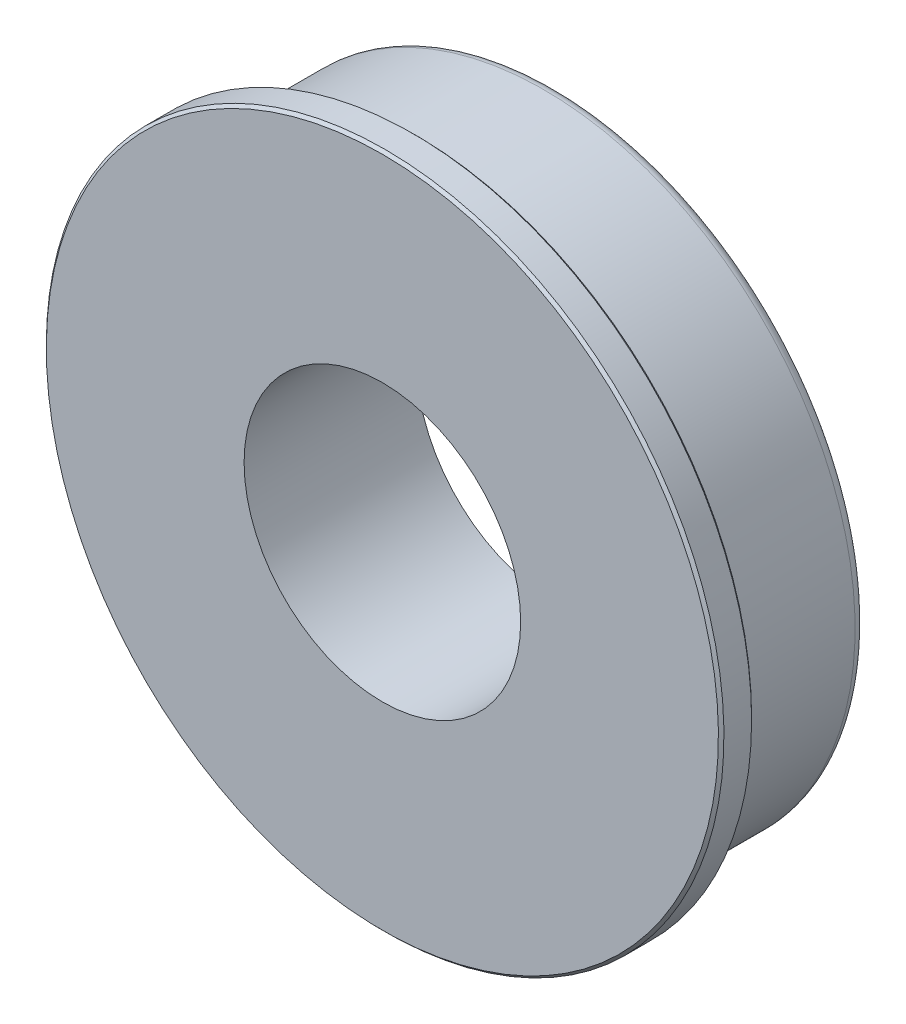
ISO-10303-21;
HEADER;
FILE_DESCRIPTION(('STEP AP214'),'2;1');
FILE_NAME('part.step','',(''),(''),'','','');
FILE_SCHEMA(('AUTOMOTIVE_DESIGN { 1 0 10303 214 1 1 1 1 }'));
ENDSEC;
DATA;
#1=APPLICATION_CONTEXT('core data for automotive mechanical design processes');
#2=APPLICATION_PROTOCOL_DEFINITION('international standard','automotive_design',2000,#1);
#3=PRODUCT_CONTEXT('',#1,'mechanical');
#4=PRODUCT('Part','Part','',(#3));
#5=PRODUCT_RELATED_PRODUCT_CATEGORY('part','',(#4));
#6=PRODUCT_DEFINITION_FORMATION('','',#4);
#7=PRODUCT_DEFINITION_CONTEXT('part definition',#1,'design');
#8=PRODUCT_DEFINITION('design','',#6,#7);
#9=PRODUCT_DEFINITION_SHAPE('','',#8);
#10=(LENGTH_UNIT() NAMED_UNIT(*) SI_UNIT(.MILLI.,.METRE.));
#11=(NAMED_UNIT(*) PLANE_ANGLE_UNIT() SI_UNIT($,.RADIAN.));
#12=(NAMED_UNIT(*) SI_UNIT($,.STERADIAN.) SOLID_ANGLE_UNIT());
#13=UNCERTAINTY_MEASURE_WITH_UNIT(LENGTH_MEASURE(1.E-05),#10,'distance_accuracy_value','');
#14=(GEOMETRIC_REPRESENTATION_CONTEXT(3) GLOBAL_UNCERTAINTY_ASSIGNED_CONTEXT((#13)) GLOBAL_UNIT_ASSIGNED_CONTEXT((#10,
#11,#12)) REPRESENTATION_CONTEXT('',''));
#15=CARTESIAN_POINT('',(0.,0.,0.));
#16=DIRECTION('',(0.,0.,1.));
#17=DIRECTION('',(1.,0.,0.));
#18=AXIS2_PLACEMENT_3D('',#15,#16,#17);
#19=CARTESIAN_POINT('',(0.,0.,-57.007125));
#20=DIRECTION('',(0.,0.,1.));
#21=DIRECTION('',(1.,0.,0.));
#22=AXIS2_PLACEMENT_3D('',#19,#20,#21);
#23=CYLINDRICAL_SURFACE('',#22,13.97);
#24=CARTESIAN_POINT('',(0.,0.,6.40334000025399));
#25=DIRECTION('',(0.,0.,1.));
#26=DIRECTION('',(1.,0.,0.));
#27=AXIS2_PLACEMENT_3D('',#24,#25,#26);
#28=CIRCLE('',#27,13.97);
#29=CARTESIAN_POINT('',(13.97,0.,6.40334000025399));
#30=VERTEX_POINT('',#29);
#31=EDGE_CURVE('E51',#30,#30,#28,.T.);
#32=ORIENTED_EDGE('',*,*,#31,.F.);
#33=EDGE_LOOP('',(#32));
#34=FACE_BOUND('',#33,.T.);
#35=CARTESIAN_POINT('',(0.,0.,5.895340000254));
#36=DIRECTION('',(0.,0.,1.));
#37=DIRECTION('',(1.,0.,0.));
#38=AXIS2_PLACEMENT_3D('',#35,#36,#37);
#39=CIRCLE('',#38,13.97);
#40=CARTESIAN_POINT('',(13.97,0.,5.895340000254));
#41=VERTEX_POINT('',#40);
#42=EDGE_CURVE('E48',#41,#41,#39,.T.);
#43=ORIENTED_EDGE('',*,*,#42,.T.);
#44=EDGE_LOOP('',(#43));
#45=FACE_BOUND('',#44,.T.);
#46=ADVANCED_FACE('F17',(#34,#45),#23,.T.);
#47=CARTESIAN_POINT('',(0.,47.3069264516129,5.89534));
#48=DIRECTION('',(0.,0.,-1.));
#49=DIRECTION('',(-1.,0.,0.));
#50=AXIS2_PLACEMENT_3D('',#47,#48,#49);
#51=PLANE('',#50);
#52=ORIENTED_EDGE('',*,*,#42,.F.);
#53=EDGE_LOOP('',(#52));
#54=FACE_BOUND('',#53,.T.);
#55=CARTESIAN_POINT('',(0.,0.,5.895340000254));
#56=DIRECTION('',(0.,0.,-1.));
#57=DIRECTION('',(-1.,0.,0.));
#58=AXIS2_PLACEMENT_3D('',#55,#56,#57);
#59=CIRCLE('',#58,14.2875);
#60=CARTESIAN_POINT('',(-14.2875,0.,5.895340000254));
#61=VERTEX_POINT('',#60);
#62=EDGE_CURVE('E54',#61,#61,#59,.T.);
#63=ORIENTED_EDGE('',*,*,#62,.F.);
#64=EDGE_LOOP('',(#63));
#65=FACE_BOUND('',#64,.T.);
#66=ADVANCED_FACE('F211',(#54,#65),#51,.F.);
#67=CARTESIAN_POINT('',(0.,0.,6.40334));
#68=DIRECTION('',(0.,0.,-1.));
#69=DIRECTION('',(-1.,0.,0.));
#70=AXIS2_PLACEMENT_3D('',#67,#68,#69);
#71=PLANE('',#70);
#72=ORIENTED_EDGE('',*,*,#31,.T.);
#73=EDGE_LOOP('',(#72));
#74=FACE_BOUND('',#73,.T.);
#75=CARTESIAN_POINT('',(0.,0.,6.40334000038116));
#76=DIRECTION('',(0.,0.,1.));
#77=DIRECTION('',(1.,0.,0.));
#78=AXIS2_PLACEMENT_3D('',#75,#76,#77);
#79=CIRCLE('',#78,15.4305000003808);
#80=CARTESIAN_POINT('',(15.4305000003808,0.,6.40334000038116));
#81=VERTEX_POINT('',#80);
#82=EDGE_CURVE('E57',#81,#81,#79,.T.);
#83=ORIENTED_EDGE('',*,*,#82,.F.);
#84=EDGE_LOOP('',(#83));
#85=FACE_BOUND('',#84,.T.);
#86=ADVANCED_FACE('F202',(#74,#85),#71,.T.);
#87=CARTESIAN_POINT('',(0.,0.,6.40334));
#88=DIRECTION('',(0.,0.,-1.));
#89=DIRECTION('',(-1.,0.,0.));
#90=AXIS2_PLACEMENT_3D('',#87,#88,#89);
#91=CYLINDRICAL_SURFACE('',#90,14.2875);
#92=CARTESIAN_POINT('',(0.,0.,0.508000000000015));
#93=DIRECTION('',(0.,0.,-1.));
#94=DIRECTION('',(-1.,0.,0.));
#95=AXIS2_PLACEMENT_3D('',#92,#93,#94);
#96=CIRCLE('',#95,14.2875);
#97=CARTESIAN_POINT('',(-14.2875,0.,0.508000000000015));
#98=VERTEX_POINT('',#97);
#99=EDGE_CURVE('E60',#98,#98,#96,.T.);
#100=ORIENTED_EDGE('',*,*,#99,.F.);
#101=EDGE_LOOP('',(#100));
#102=FACE_BOUND('',#101,.T.);
#103=ORIENTED_EDGE('',*,*,#62,.T.);
#104=EDGE_LOOP('',(#103));
#105=FACE_BOUND('',#104,.T.);
#106=ADVANCED_FACE('F193',(#102,#105),#91,.T.);
#107=CARTESIAN_POINT('',(0.,0.,6.53034000038083));
#108=DIRECTION('',(0.,0.,1.));
#109=DIRECTION('',(1.,0.,0.));
#110=AXIS2_PLACEMENT_3D('',#107,#108,#109);
#111=CONICAL_SURFACE('',#110,15.5575000003812,0.785398163399999);
#112=ORIENTED_EDGE('',*,*,#82,.T.);
#113=EDGE_LOOP('',(#112));
#114=FACE_BOUND('',#113,.T.);
#115=CARTESIAN_POINT('',(0.,0.,6.530340000254));
#116=DIRECTION('',(0.,0.,-1.));
#117=DIRECTION('',(-1.,0.,0.));
#118=AXIS2_PLACEMENT_3D('',#115,#116,#117);
#119=CIRCLE('',#118,15.5575);
#120=CARTESIAN_POINT('',(-15.5575,0.,6.530340000254));
#121=VERTEX_POINT('',#120);
#122=EDGE_CURVE('E46',#121,#121,#119,.F.);
#123=ORIENTED_EDGE('',*,*,#122,.F.);
#124=EDGE_LOOP('',(#123));
#125=FACE_BOUND('',#124,.T.);
#126=ADVANCED_FACE('F81',(#114,#125),#111,.T.);
#127=CARTESIAN_POINT('',(0.,0.,0.508000000000015));
#128=DIRECTION('',(0.,0.,-1.));
#129=DIRECTION('',(-1.,0.,0.));
#130=AXIS2_PLACEMENT_3D('',#127,#128,#129);
#131=TOROIDAL_SURFACE('',#130,13.7795,0.508);
#132=ORIENTED_EDGE('',*,*,#99,.T.);
#133=EDGE_LOOP('',(#132));
#134=FACE_BOUND('',#133,.T.);
#135=CARTESIAN_POINT('',(0.,0.,0.));
#136=DIRECTION('',(0.,0.,1.));
#137=DIRECTION('',(-1.,0.,0.));
#138=AXIS2_PLACEMENT_3D('',#135,#136,#137);
#139=CIRCLE('',#138,13.7795);
#140=CARTESIAN_POINT('',(13.7795,0.,0.));
#141=VERTEX_POINT('',#140);
#142=CARTESIAN_POINT('',(-13.7795,0.,0.));
#143=VERTEX_POINT('',#142);
#144=EDGE_CURVE('E37',#141,#143,#139,.F.);
#145=ORIENTED_EDGE('',*,*,#144,.F.);
#146=CARTESIAN_POINT('',(0.,0.,0.));
#147=DIRECTION('',(0.,0.,1.));
#148=DIRECTION('',(1.,0.,0.));
#149=AXIS2_PLACEMENT_3D('',#146,#147,#148);
#150=CIRCLE('',#149,13.7795);
#151=EDGE_CURVE('E34',#143,#141,#150,.F.);
#152=ORIENTED_EDGE('',*,*,#151,.F.);
#153=EDGE_LOOP('',(#145,#152));
#154=FACE_BOUND('',#153,.T.);
#155=ADVANCED_FACE('F45',(#134,#154),#131,.T.);
#156=CARTESIAN_POINT('',(0.,0.,7.92734));
#157=DIRECTION('',(0.,0.,-1.));
#158=DIRECTION('',(-1.,0.,0.));
#159=AXIS2_PLACEMENT_3D('',#156,#157,#158);
#160=CYLINDRICAL_SURFACE('',#159,15.5575);
#161=ORIENTED_EDGE('',*,*,#122,.T.);
#162=EDGE_LOOP('',(#161));
#163=FACE_BOUND('',#162,.T.);
#164=CARTESIAN_POINT('',(0.,0.,7.80034000012699));
#165=DIRECTION('',(0.,0.,-1.));
#166=DIRECTION('',(-1.,0.,0.));
#167=AXIS2_PLACEMENT_3D('',#164,#165,#166);
#168=CIRCLE('',#167,15.557499999873);
#169=CARTESIAN_POINT('',(-15.557499999873,0.,7.80034000012699));
#170=VERTEX_POINT('',#169);
#171=EDGE_CURVE('E42',#170,#170,#168,.F.);
#172=ORIENTED_EDGE('',*,*,#171,.F.);
#173=EDGE_LOOP('',(#172));
#174=FACE_BOUND('',#173,.T.);
#175=ADVANCED_FACE('F80',(#163,#174),#160,.T.);
#176=CARTESIAN_POINT('',(0.,0.,0.));
#177=DIRECTION('',(0.,0.,-1.));
#178=DIRECTION('',(-1.,0.,0.));
#179=AXIS2_PLACEMENT_3D('',#176,#177,#178);
#180=PLANE('',#179);
#181=CARTESIAN_POINT('',(0.,0.,0.));
#182=DIRECTION('',(0.,0.,1.));
#183=DIRECTION('',(1.,0.,0.));
#184=AXIS2_PLACEMENT_3D('',#181,#182,#183);
#185=CIRCLE('',#184,6.35);
#186=CARTESIAN_POINT('',(6.35000000000001,0.,0.));
#187=VERTEX_POINT('',#186);
#188=EDGE_CURVE('E61',#187,#187,#185,.T.);
#189=ORIENTED_EDGE('',*,*,#188,.T.);
#190=EDGE_LOOP('',(#189));
#191=FACE_BOUND('',#190,.T.);
#192=ORIENTED_EDGE('',*,*,#151,.T.);
#193=ORIENTED_EDGE('',*,*,#144,.T.);
#194=EDGE_LOOP('',(#192,#193));
#195=FACE_BOUND('',#194,.T.);
#196=ADVANCED_FACE('F39',(#191,#195),#180,.T.);
#197=CARTESIAN_POINT('',(0.,0.,7.80034000012699));
#198=DIRECTION('',(0.,0.,-1.));
#199=DIRECTION('',(0.,1.,0.));
#200=AXIS2_PLACEMENT_3D('',#197,#198,#199);
#201=CONICAL_SURFACE('',#200,15.557499999873,0.785398163399996);
#202=CARTESIAN_POINT('',(0.,0.,7.92734000012666));
#203=DIRECTION('',(0.,0.,-1.));
#204=DIRECTION('',(0.,1.,0.));
#205=AXIS2_PLACEMENT_3D('',#202,#203,#204);
#206=CIRCLE('',#205,15.4304999998727);
#207=CARTESIAN_POINT('',(0.,15.4304999998727,7.92734000012666));
#208=VERTEX_POINT('',#207);
#209=EDGE_CURVE('E27',#208,#208,#206,.T.);
#210=ORIENTED_EDGE('',*,*,#209,.T.);
#211=EDGE_LOOP('',(#210));
#212=FACE_BOUND('',#211,.T.);
#213=ORIENTED_EDGE('',*,*,#171,.T.);
#214=EDGE_LOOP('',(#213));
#215=FACE_BOUND('',#214,.T.);
#216=ADVANCED_FACE('F101',(#212,#215),#201,.T.);
#217=CARTESIAN_POINT('',(0.,0.,7.92734));
#218=DIRECTION('',(0.,0.,1.));
#219=DIRECTION('',(1.,0.,0.));
#220=AXIS2_PLACEMENT_3D('',#217,#218,#219);
#221=CYLINDRICAL_SURFACE('',#220,6.35);
#222=CARTESIAN_POINT('',(0.,0.,7.927340000254));
#223=DIRECTION('',(0.,0.,1.));
#224=DIRECTION('',(1.,0.,0.));
#225=AXIS2_PLACEMENT_3D('',#222,#223,#224);
#226=CIRCLE('',#225,6.35);
#227=CARTESIAN_POINT('',(6.35000000000001,0.,7.927340000254));
#228=VERTEX_POINT('',#227);
#229=EDGE_CURVE('E11',#228,#228,#226,.T.);
#230=ORIENTED_EDGE('',*,*,#229,.T.);
#231=EDGE_LOOP('',(#230));
#232=FACE_BOUND('',#231,.T.);
#233=ORIENTED_EDGE('',*,*,#188,.F.);
#234=EDGE_LOOP('',(#233));
#235=FACE_BOUND('',#234,.T.);
#236=ADVANCED_FACE('F126',(#232,#235),#221,.F.);
#237=CARTESIAN_POINT('',(0.,0.,7.92734));
#238=DIRECTION('',(0.,0.,-1.));
#239=DIRECTION('',(-1.,0.,0.));
#240=AXIS2_PLACEMENT_3D('',#237,#238,#239);
#241=PLANE('',#240);
#242=ORIENTED_EDGE('',*,*,#229,.F.);
#243=EDGE_LOOP('',(#242));
#244=FACE_BOUND('',#243,.T.);
#245=ORIENTED_EDGE('',*,*,#209,.F.);
#246=EDGE_LOOP('',(#245));
#247=FACE_BOUND('',#246,.T.);
#248=ADVANCED_FACE('F124',(#244,#247),#241,.F.);
#249=CLOSED_SHELL('',(#46,#66,#86,#106,#126,#155,#175,#196,#216,#236,#248));
#250=MANIFOLD_SOLID_BREP('B1',#249);
#251=ADVANCED_BREP_SHAPE_REPRESENTATION('',(#18,#250),#14);
#252=SHAPE_DEFINITION_REPRESENTATION(#9,#251);
ENDSEC;
END-ISO-10303-21;
